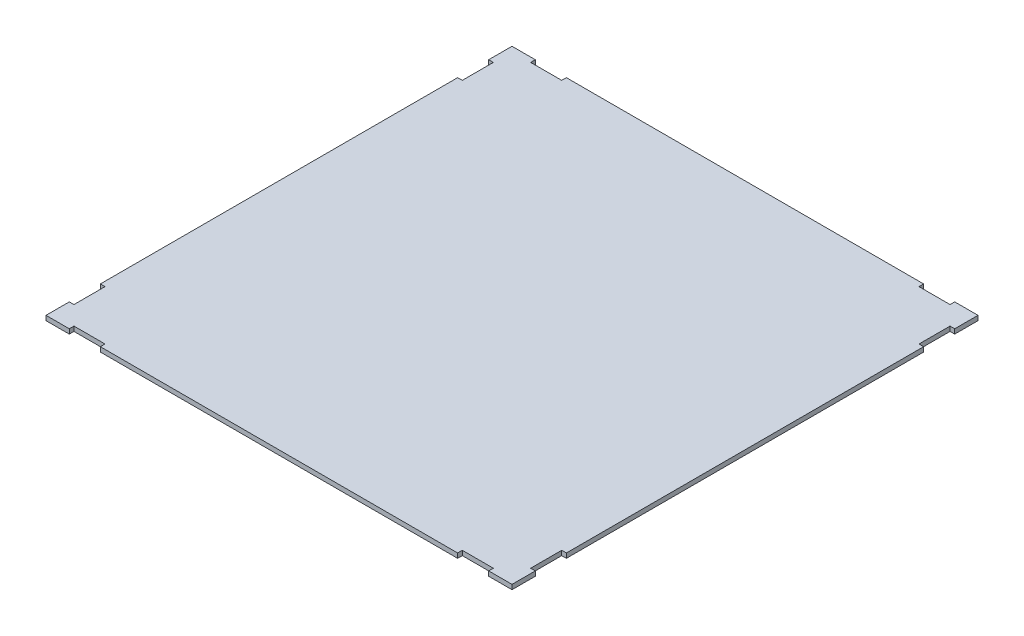
ISO-10303-21;
HEADER;
FILE_DESCRIPTION(('STEP AP214'),'2;1');
FILE_NAME('part.step','',(''),(''),'','','');
FILE_SCHEMA(('AUTOMOTIVE_DESIGN { 1 0 10303 214 1 1 1 1 }'));
ENDSEC;
DATA;
#1=APPLICATION_CONTEXT('core data for automotive mechanical design processes');
#2=APPLICATION_PROTOCOL_DEFINITION('international standard','automotive_design',2000,#1);
#3=PRODUCT_CONTEXT('',#1,'mechanical');
#4=PRODUCT('Part','Part','',(#3));
#5=PRODUCT_RELATED_PRODUCT_CATEGORY('part','',(#4));
#6=PRODUCT_DEFINITION_FORMATION('','',#4);
#7=PRODUCT_DEFINITION_CONTEXT('part definition',#1,'design');
#8=PRODUCT_DEFINITION('design','',#6,#7);
#9=PRODUCT_DEFINITION_SHAPE('','',#8);
#10=(LENGTH_UNIT() NAMED_UNIT(*) SI_UNIT(.MILLI.,.METRE.));
#11=(NAMED_UNIT(*) PLANE_ANGLE_UNIT() SI_UNIT($,.RADIAN.));
#12=(NAMED_UNIT(*) SI_UNIT($,.STERADIAN.) SOLID_ANGLE_UNIT());
#13=UNCERTAINTY_MEASURE_WITH_UNIT(LENGTH_MEASURE(1.E-05),#10,'distance_accuracy_value','');
#14=(GEOMETRIC_REPRESENTATION_CONTEXT(3) GLOBAL_UNCERTAINTY_ASSIGNED_CONTEXT((#13)) GLOBAL_UNIT_ASSIGNED_CONTEXT((#10,
#11,#12)) REPRESENTATION_CONTEXT('',''));
#15=CARTESIAN_POINT('',(0.,0.,0.));
#16=DIRECTION('',(0.,0.,1.));
#17=DIRECTION('',(1.,0.,0.));
#18=AXIS2_PLACEMENT_3D('',#15,#16,#17);
#19=CARTESIAN_POINT('',(0.,3.,0.));
#20=DIRECTION('',(1.,0.,0.));
#21=DIRECTION('',(0.,0.,-1.));
#22=AXIS2_PLACEMENT_3D('',#19,#20,#21);
#23=PLANE('',#22);
#24=DIRECTION('',(0.,0.,1.));
#25=VECTOR('',#24,1.);
#26=CARTESIAN_POINT('',(0.,0.,0.));
#27=LINE('',#26,#25);
#28=CARTESIAN_POINT('',(0.,0.,-15.));
#29=VERTEX_POINT('',#28);
#30=CARTESIAN_POINT('',(0.,0.,0.));
#31=VERTEX_POINT('',#30);
#32=EDGE_CURVE('E297',#29,#31,#27,.T.);
#33=ORIENTED_EDGE('',*,*,#32,.T.);
#34=DIRECTION('',(0.,-1.,0.));
#35=VECTOR('',#34,1.);
#36=CARTESIAN_POINT('',(0.,3.,0.));
#37=LINE('',#36,#35);
#38=CARTESIAN_POINT('',(0.,3.,0.));
#39=VERTEX_POINT('',#38);
#40=EDGE_CURVE('E11',#39,#31,#37,.T.);
#41=ORIENTED_EDGE('',*,*,#40,.F.);
#42=DIRECTION('',(0.,0.,1.));
#43=VECTOR('',#42,1.);
#44=CARTESIAN_POINT('',(0.,3.,0.));
#45=LINE('',#44,#43);
#46=CARTESIAN_POINT('',(0.,3.,-15.));
#47=VERTEX_POINT('',#46);
#48=EDGE_CURVE('E367',#47,#39,#45,.T.);
#49=ORIENTED_EDGE('',*,*,#48,.F.);
#50=DIRECTION('',(0.,-1.,0.));
#51=VECTOR('',#50,1.);
#52=CARTESIAN_POINT('',(0.,3.,-15.));
#53=LINE('',#52,#51);
#54=EDGE_CURVE('E293',#47,#29,#53,.T.);
#55=ORIENTED_EDGE('',*,*,#54,.T.);
#56=EDGE_LOOP('',(#33,#41,#49,#55));
#57=FACE_BOUND('',#56,.T.);
#58=ADVANCED_FACE('F33',(#57),#23,.F.);
#59=CARTESIAN_POINT('',(0.,3.,0.));
#60=DIRECTION('',(0.,0.,-1.));
#61=DIRECTION('',(-1.,0.,0.));
#62=AXIS2_PLACEMENT_3D('',#59,#60,#61);
#63=PLANE('',#62);
#64=DIRECTION('',(1.,0.,0.));
#65=VECTOR('',#64,1.);
#66=CARTESIAN_POINT('',(0.,0.,0.));
#67=LINE('',#66,#65);
#68=CARTESIAN_POINT('',(15.,0.,0.));
#69=VERTEX_POINT('',#68);
#70=EDGE_CURVE('E300',#31,#69,#67,.T.);
#71=ORIENTED_EDGE('',*,*,#70,.T.);
#72=DIRECTION('',(0.,-1.,0.));
#73=VECTOR('',#72,1.);
#74=CARTESIAN_POINT('',(15.,3.,0.));
#75=LINE('',#74,#73);
#76=CARTESIAN_POINT('',(15.,3.,0.));
#77=VERTEX_POINT('',#76);
#78=EDGE_CURVE('E41',#77,#69,#75,.T.);
#79=ORIENTED_EDGE('',*,*,#78,.F.);
#80=DIRECTION('',(1.,0.,0.));
#81=VECTOR('',#80,1.);
#82=CARTESIAN_POINT('',(0.,3.,0.));
#83=LINE('',#82,#81);
#84=EDGE_CURVE('E176',#39,#77,#83,.T.);
#85=ORIENTED_EDGE('',*,*,#84,.F.);
#86=ORIENTED_EDGE('',*,*,#40,.T.);
#87=EDGE_LOOP('',(#71,#79,#85,#86));
#88=FACE_BOUND('',#87,.T.);
#89=ADVANCED_FACE('F565',(#88),#63,.F.);
#90=CARTESIAN_POINT('',(15.,3.,0.));
#91=DIRECTION('',(-1.,0.,0.));
#92=DIRECTION('',(0.,0.,1.));
#93=AXIS2_PLACEMENT_3D('',#90,#91,#92);
#94=PLANE('',#93);
#95=DIRECTION('',(0.,0.,-1.));
#96=VECTOR('',#95,1.);
#97=CARTESIAN_POINT('',(15.,0.,0.));
#98=LINE('',#97,#96);
#99=CARTESIAN_POINT('',(15.,0.,-3.));
#100=VERTEX_POINT('',#99);
#101=EDGE_CURVE('E302',#69,#100,#98,.T.);
#102=ORIENTED_EDGE('',*,*,#101,.T.);
#103=DIRECTION('',(0.,-1.,0.));
#104=VECTOR('',#103,1.);
#105=CARTESIAN_POINT('',(15.,3.,-3.));
#106=LINE('',#105,#104);
#107=CARTESIAN_POINT('',(15.,3.,-3.));
#108=VERTEX_POINT('',#107);
#109=EDGE_CURVE('E458',#108,#100,#106,.T.);
#110=ORIENTED_EDGE('',*,*,#109,.F.);
#111=DIRECTION('',(0.,0.,-1.));
#112=VECTOR('',#111,1.);
#113=CARTESIAN_POINT('',(15.,3.,0.));
#114=LINE('',#113,#112);
#115=EDGE_CURVE('E466',#77,#108,#114,.T.);
#116=ORIENTED_EDGE('',*,*,#115,.F.);
#117=ORIENTED_EDGE('',*,*,#78,.T.);
#118=EDGE_LOOP('',(#102,#110,#116,#117));
#119=FACE_BOUND('',#118,.T.);
#120=ADVANCED_FACE('F464',(#119),#94,.F.);
#121=CARTESIAN_POINT('',(15.,3.,-3.));
#122=DIRECTION('',(0.,0.,-1.));
#123=DIRECTION('',(-1.,0.,0.));
#124=AXIS2_PLACEMENT_3D('',#121,#122,#123);
#125=PLANE('',#124);
#126=DIRECTION('',(1.,0.,0.));
#127=VECTOR('',#126,1.);
#128=CARTESIAN_POINT('',(15.,0.,-3.));
#129=LINE('',#128,#127);
#130=CARTESIAN_POINT('',(35.,0.,-3.));
#131=VERTEX_POINT('',#130);
#132=EDGE_CURVE('E304',#100,#131,#129,.T.);
#133=ORIENTED_EDGE('',*,*,#132,.T.);
#134=DIRECTION('',(0.,-1.,0.));
#135=VECTOR('',#134,1.);
#136=CARTESIAN_POINT('',(35.,3.,-3.));
#137=LINE('',#136,#135);
#138=CARTESIAN_POINT('',(35.,3.,-3.));
#139=VERTEX_POINT('',#138);
#140=EDGE_CURVE('E455',#139,#131,#137,.T.);
#141=ORIENTED_EDGE('',*,*,#140,.F.);
#142=DIRECTION('',(1.,0.,0.));
#143=VECTOR('',#142,1.);
#144=CARTESIAN_POINT('',(15.,3.,-3.));
#145=LINE('',#144,#143);
#146=EDGE_CURVE('E484',#108,#139,#145,.T.);
#147=ORIENTED_EDGE('',*,*,#146,.F.);
#148=ORIENTED_EDGE('',*,*,#109,.T.);
#149=EDGE_LOOP('',(#133,#141,#147,#148));
#150=FACE_BOUND('',#149,.T.);
#151=ADVANCED_FACE('F475',(#150),#125,.F.);
#152=CARTESIAN_POINT('',(35.,3.,-3.));
#153=DIRECTION('',(1.,0.,0.));
#154=DIRECTION('',(0.,0.,-1.));
#155=AXIS2_PLACEMENT_3D('',#152,#153,#154);
#156=PLANE('',#155);
#157=DIRECTION('',(0.,0.,1.));
#158=VECTOR('',#157,1.);
#159=CARTESIAN_POINT('',(35.,0.,-3.));
#160=LINE('',#159,#158);
#161=CARTESIAN_POINT('',(35.,0.,0.));
#162=VERTEX_POINT('',#161);
#163=EDGE_CURVE('E306',#131,#162,#160,.T.);
#164=ORIENTED_EDGE('',*,*,#163,.T.);
#165=DIRECTION('',(0.,-1.,0.));
#166=VECTOR('',#165,1.);
#167=CARTESIAN_POINT('',(35.,3.,0.));
#168=LINE('',#167,#166);
#169=CARTESIAN_POINT('',(35.,3.,0.));
#170=VERTEX_POINT('',#169);
#171=EDGE_CURVE('E452',#170,#162,#168,.T.);
#172=ORIENTED_EDGE('',*,*,#171,.F.);
#173=DIRECTION('',(0.,0.,1.));
#174=VECTOR('',#173,1.);
#175=CARTESIAN_POINT('',(35.,3.,-3.));
#176=LINE('',#175,#174);
#177=EDGE_CURVE('E481',#139,#170,#176,.T.);
#178=ORIENTED_EDGE('',*,*,#177,.F.);
#179=ORIENTED_EDGE('',*,*,#140,.T.);
#180=EDGE_LOOP('',(#164,#172,#178,#179));
#181=FACE_BOUND('',#180,.T.);
#182=ADVANCED_FACE('F479',(#181),#156,.F.);
#183=CARTESIAN_POINT('',(35.,3.,0.));
#184=DIRECTION('',(0.,0.,-1.));
#185=DIRECTION('',(-1.,0.,0.));
#186=AXIS2_PLACEMENT_3D('',#183,#184,#185);
#187=PLANE('',#186);
#188=DIRECTION('',(1.,0.,0.));
#189=VECTOR('',#188,1.);
#190=CARTESIAN_POINT('',(35.,0.,0.));
#191=LINE('',#190,#189);
#192=CARTESIAN_POINT('',(265.,0.,0.));
#193=VERTEX_POINT('',#192);
#194=EDGE_CURVE('E308',#162,#193,#191,.T.);
#195=ORIENTED_EDGE('',*,*,#194,.T.);
#196=DIRECTION('',(0.,-1.,0.));
#197=VECTOR('',#196,1.);
#198=CARTESIAN_POINT('',(265.,3.,0.));
#199=LINE('',#198,#197);
#200=CARTESIAN_POINT('',(265.,3.,0.));
#201=VERTEX_POINT('',#200);
#202=EDGE_CURVE('E449',#201,#193,#199,.T.);
#203=ORIENTED_EDGE('',*,*,#202,.F.);
#204=DIRECTION('',(1.,0.,0.));
#205=VECTOR('',#204,1.);
#206=CARTESIAN_POINT('',(35.,3.,0.));
#207=LINE('',#206,#205);
#208=EDGE_CURVE('E483',#170,#201,#207,.T.);
#209=ORIENTED_EDGE('',*,*,#208,.F.);
#210=ORIENTED_EDGE('',*,*,#171,.T.);
#211=EDGE_LOOP('',(#195,#203,#209,#210));
#212=FACE_BOUND('',#211,.T.);
#213=ADVANCED_FACE('F578',(#212),#187,.F.);
#214=CARTESIAN_POINT('',(265.,3.,-3.));
#215=DIRECTION('',(-1.,0.,0.));
#216=DIRECTION('',(0.,0.,1.));
#217=AXIS2_PLACEMENT_3D('',#214,#215,#216);
#218=PLANE('',#217);
#219=DIRECTION('',(0.,0.,-1.));
#220=VECTOR('',#219,1.);
#221=CARTESIAN_POINT('',(265.,0.,-3.));
#222=LINE('',#221,#220);
#223=CARTESIAN_POINT('',(265.,0.,-3.));
#224=VERTEX_POINT('',#223);
#225=EDGE_CURVE('E310',#193,#224,#222,.T.);
#226=ORIENTED_EDGE('',*,*,#225,.T.);
#227=DIRECTION('',(0.,-1.,0.));
#228=VECTOR('',#227,1.);
#229=CARTESIAN_POINT('',(265.,3.,-3.));
#230=LINE('',#229,#228);
#231=CARTESIAN_POINT('',(265.,3.,-3.));
#232=VERTEX_POINT('',#231);
#233=EDGE_CURVE('E446',#232,#224,#230,.T.);
#234=ORIENTED_EDGE('',*,*,#233,.F.);
#235=DIRECTION('',(0.,0.,-1.));
#236=VECTOR('',#235,1.);
#237=CARTESIAN_POINT('',(265.,3.,-3.));
#238=LINE('',#237,#236);
#239=EDGE_CURVE('E486',#201,#232,#238,.T.);
#240=ORIENTED_EDGE('',*,*,#239,.F.);
#241=ORIENTED_EDGE('',*,*,#202,.T.);
#242=EDGE_LOOP('',(#226,#234,#240,#241));
#243=FACE_BOUND('',#242,.T.);
#244=ADVANCED_FACE('F581',(#243),#218,.F.);
#245=CARTESIAN_POINT('',(285.,3.,-3.));
#246=DIRECTION('',(0.,0.,-1.));
#247=DIRECTION('',(-1.,0.,0.));
#248=AXIS2_PLACEMENT_3D('',#245,#246,#247);
#249=PLANE('',#248);
#250=DIRECTION('',(1.,0.,0.));
#251=VECTOR('',#250,1.);
#252=CARTESIAN_POINT('',(285.,0.,-3.));
#253=LINE('',#252,#251);
#254=CARTESIAN_POINT('',(285.,0.,-3.));
#255=VERTEX_POINT('',#254);
#256=EDGE_CURVE('E312',#224,#255,#253,.T.);
#257=ORIENTED_EDGE('',*,*,#256,.T.);
#258=DIRECTION('',(0.,-1.,0.));
#259=VECTOR('',#258,1.);
#260=CARTESIAN_POINT('',(285.,3.,-3.));
#261=LINE('',#260,#259);
#262=CARTESIAN_POINT('',(285.,3.,-3.));
#263=VERTEX_POINT('',#262);
#264=EDGE_CURVE('E443',#263,#255,#261,.T.);
#265=ORIENTED_EDGE('',*,*,#264,.F.);
#266=DIRECTION('',(1.,0.,0.));
#267=VECTOR('',#266,1.);
#268=CARTESIAN_POINT('',(285.,3.,-3.));
#269=LINE('',#268,#267);
#270=EDGE_CURVE('E492',#232,#263,#269,.T.);
#271=ORIENTED_EDGE('',*,*,#270,.F.);
#272=ORIENTED_EDGE('',*,*,#233,.T.);
#273=EDGE_LOOP('',(#257,#265,#271,#272));
#274=FACE_BOUND('',#273,.T.);
#275=ADVANCED_FACE('F585',(#274),#249,.F.);
#276=CARTESIAN_POINT('',(285.,3.,0.));
#277=DIRECTION('',(1.,0.,0.));
#278=DIRECTION('',(0.,0.,-1.));
#279=AXIS2_PLACEMENT_3D('',#276,#277,#278);
#280=PLANE('',#279);
#281=DIRECTION('',(0.,0.,1.));
#282=VECTOR('',#281,1.);
#283=CARTESIAN_POINT('',(285.,0.,0.));
#284=LINE('',#283,#282);
#285=CARTESIAN_POINT('',(285.,0.,0.));
#286=VERTEX_POINT('',#285);
#287=EDGE_CURVE('E314',#255,#286,#284,.T.);
#288=ORIENTED_EDGE('',*,*,#287,.T.);
#289=DIRECTION('',(0.,-1.,0.));
#290=VECTOR('',#289,1.);
#291=CARTESIAN_POINT('',(285.,3.,0.));
#292=LINE('',#291,#290);
#293=CARTESIAN_POINT('',(285.,3.,0.));
#294=VERTEX_POINT('',#293);
#295=EDGE_CURVE('E440',#294,#286,#292,.T.);
#296=ORIENTED_EDGE('',*,*,#295,.F.);
#297=DIRECTION('',(0.,0.,1.));
#298=VECTOR('',#297,1.);
#299=CARTESIAN_POINT('',(285.,3.,0.));
#300=LINE('',#299,#298);
#301=EDGE_CURVE('E494',#263,#294,#300,.T.);
#302=ORIENTED_EDGE('',*,*,#301,.F.);
#303=ORIENTED_EDGE('',*,*,#264,.T.);
#304=EDGE_LOOP('',(#288,#296,#302,#303));
#305=FACE_BOUND('',#304,.T.);
#306=ADVANCED_FACE('F589',(#305),#280,.F.);
#307=CARTESIAN_POINT('',(300.,3.,0.));
#308=DIRECTION('',(0.,0.,-1.));
#309=DIRECTION('',(-1.,0.,0.));
#310=AXIS2_PLACEMENT_3D('',#307,#308,#309);
#311=PLANE('',#310);
#312=DIRECTION('',(1.,0.,0.));
#313=VECTOR('',#312,1.);
#314=CARTESIAN_POINT('',(300.,0.,0.));
#315=LINE('',#314,#313);
#316=CARTESIAN_POINT('',(300.,0.,0.));
#317=VERTEX_POINT('',#316);
#318=EDGE_CURVE('E316',#286,#317,#315,.T.);
#319=ORIENTED_EDGE('',*,*,#318,.T.);
#320=DIRECTION('',(0.,-1.,0.));
#321=VECTOR('',#320,1.);
#322=CARTESIAN_POINT('',(300.,3.,0.));
#323=LINE('',#322,#321);
#324=CARTESIAN_POINT('',(300.,3.,0.));
#325=VERTEX_POINT('',#324);
#326=EDGE_CURVE('E437',#325,#317,#323,.T.);
#327=ORIENTED_EDGE('',*,*,#326,.F.);
#328=DIRECTION('',(1.,0.,0.));
#329=VECTOR('',#328,1.);
#330=CARTESIAN_POINT('',(300.,3.,0.));
#331=LINE('',#330,#329);
#332=EDGE_CURVE('E496',#294,#325,#331,.T.);
#333=ORIENTED_EDGE('',*,*,#332,.F.);
#334=ORIENTED_EDGE('',*,*,#295,.T.);
#335=EDGE_LOOP('',(#319,#327,#333,#334));
#336=FACE_BOUND('',#335,.T.);
#337=ADVANCED_FACE('F593',(#336),#311,.F.);
#338=CARTESIAN_POINT('',(300.,3.,0.));
#339=DIRECTION('',(-1.,0.,0.));
#340=DIRECTION('',(0.,0.,1.));
#341=AXIS2_PLACEMENT_3D('',#338,#339,#340);
#342=PLANE('',#341);
#343=DIRECTION('',(0.,0.,-1.));
#344=VECTOR('',#343,1.);
#345=CARTESIAN_POINT('',(300.,0.,0.));
#346=LINE('',#345,#344);
#347=CARTESIAN_POINT('',(300.,0.,-15.));
#348=VERTEX_POINT('',#347);
#349=EDGE_CURVE('E318',#317,#348,#346,.T.);
#350=ORIENTED_EDGE('',*,*,#349,.T.);
#351=DIRECTION('',(0.,-1.,0.));
#352=VECTOR('',#351,1.);
#353=CARTESIAN_POINT('',(300.,3.,-15.));
#354=LINE('',#353,#352);
#355=CARTESIAN_POINT('',(300.,3.,-15.));
#356=VERTEX_POINT('',#355);
#357=EDGE_CURVE('E434',#356,#348,#354,.T.);
#358=ORIENTED_EDGE('',*,*,#357,.F.);
#359=DIRECTION('',(0.,0.,-1.));
#360=VECTOR('',#359,1.);
#361=CARTESIAN_POINT('',(300.,3.,0.));
#362=LINE('',#361,#360);
#363=EDGE_CURVE('E498',#325,#356,#362,.T.);
#364=ORIENTED_EDGE('',*,*,#363,.F.);
#365=ORIENTED_EDGE('',*,*,#326,.T.);
#366=EDGE_LOOP('',(#350,#358,#364,#365));
#367=FACE_BOUND('',#366,.T.);
#368=ADVANCED_FACE('F597',(#367),#342,.F.);
#369=CARTESIAN_POINT('',(300.,3.,-15.));
#370=DIRECTION('',(0.,0.,1.));
#371=DIRECTION('',(1.,0.,0.));
#372=AXIS2_PLACEMENT_3D('',#369,#370,#371);
#373=PLANE('',#372);
#374=DIRECTION('',(-1.,0.,0.));
#375=VECTOR('',#374,1.);
#376=CARTESIAN_POINT('',(300.,0.,-15.));
#377=LINE('',#376,#375);
#378=CARTESIAN_POINT('',(297.,0.,-15.));
#379=VERTEX_POINT('',#378);
#380=EDGE_CURVE('E320',#348,#379,#377,.T.);
#381=ORIENTED_EDGE('',*,*,#380,.T.);
#382=DIRECTION('',(0.,-1.,0.));
#383=VECTOR('',#382,1.);
#384=CARTESIAN_POINT('',(297.,3.,-15.));
#385=LINE('',#384,#383);
#386=CARTESIAN_POINT('',(297.,3.,-15.));
#387=VERTEX_POINT('',#386);
#388=EDGE_CURVE('E431',#387,#379,#385,.T.);
#389=ORIENTED_EDGE('',*,*,#388,.F.);
#390=DIRECTION('',(-1.,0.,0.));
#391=VECTOR('',#390,1.);
#392=CARTESIAN_POINT('',(300.,3.,-15.));
#393=LINE('',#392,#391);
#394=EDGE_CURVE('E500',#356,#387,#393,.T.);
#395=ORIENTED_EDGE('',*,*,#394,.F.);
#396=ORIENTED_EDGE('',*,*,#357,.T.);
#397=EDGE_LOOP('',(#381,#389,#395,#396));
#398=FACE_BOUND('',#397,.T.);
#399=ADVANCED_FACE('F601',(#398),#373,.F.);
#400=CARTESIAN_POINT('',(297.,3.,-15.));
#401=DIRECTION('',(-1.,0.,0.));
#402=DIRECTION('',(0.,0.,1.));
#403=AXIS2_PLACEMENT_3D('',#400,#401,#402);
#404=PLANE('',#403);
#405=DIRECTION('',(0.,0.,-1.));
#406=VECTOR('',#405,1.);
#407=CARTESIAN_POINT('',(297.,0.,-15.));
#408=LINE('',#407,#406);
#409=CARTESIAN_POINT('',(297.,0.,-35.));
#410=VERTEX_POINT('',#409);
#411=EDGE_CURVE('E322',#379,#410,#408,.T.);
#412=ORIENTED_EDGE('',*,*,#411,.T.);
#413=DIRECTION('',(0.,-1.,0.));
#414=VECTOR('',#413,1.);
#415=CARTESIAN_POINT('',(297.,3.,-35.));
#416=LINE('',#415,#414);
#417=CARTESIAN_POINT('',(297.,3.,-35.));
#418=VERTEX_POINT('',#417);
#419=EDGE_CURVE('E428',#418,#410,#416,.T.);
#420=ORIENTED_EDGE('',*,*,#419,.F.);
#421=DIRECTION('',(0.,0.,-1.));
#422=VECTOR('',#421,1.);
#423=CARTESIAN_POINT('',(297.,3.,-15.));
#424=LINE('',#423,#422);
#425=EDGE_CURVE('E502',#387,#418,#424,.T.);
#426=ORIENTED_EDGE('',*,*,#425,.F.);
#427=ORIENTED_EDGE('',*,*,#388,.T.);
#428=EDGE_LOOP('',(#412,#420,#426,#427));
#429=FACE_BOUND('',#428,.T.);
#430=ADVANCED_FACE('F605',(#429),#404,.F.);
#431=CARTESIAN_POINT('',(297.,3.,-35.));
#432=DIRECTION('',(0.,0.,-1.));
#433=DIRECTION('',(-1.,0.,0.));
#434=AXIS2_PLACEMENT_3D('',#431,#432,#433);
#435=PLANE('',#434);
#436=DIRECTION('',(1.,0.,0.));
#437=VECTOR('',#436,1.);
#438=CARTESIAN_POINT('',(297.,0.,-35.));
#439=LINE('',#438,#437);
#440=CARTESIAN_POINT('',(300.,0.,-35.));
#441=VERTEX_POINT('',#440);
#442=EDGE_CURVE('E324',#410,#441,#439,.T.);
#443=ORIENTED_EDGE('',*,*,#442,.T.);
#444=DIRECTION('',(0.,-1.,0.));
#445=VECTOR('',#444,1.);
#446=CARTESIAN_POINT('',(300.,3.,-35.));
#447=LINE('',#446,#445);
#448=CARTESIAN_POINT('',(300.,3.,-35.));
#449=VERTEX_POINT('',#448);
#450=EDGE_CURVE('E425',#449,#441,#447,.T.);
#451=ORIENTED_EDGE('',*,*,#450,.F.);
#452=DIRECTION('',(1.,0.,0.));
#453=VECTOR('',#452,1.);
#454=CARTESIAN_POINT('',(297.,3.,-35.));
#455=LINE('',#454,#453);
#456=EDGE_CURVE('E504',#418,#449,#455,.T.);
#457=ORIENTED_EDGE('',*,*,#456,.F.);
#458=ORIENTED_EDGE('',*,*,#419,.T.);
#459=EDGE_LOOP('',(#443,#451,#457,#458));
#460=FACE_BOUND('',#459,.T.);
#461=ADVANCED_FACE('F609',(#460),#435,.F.);
#462=CARTESIAN_POINT('',(300.,3.,-35.));
#463=DIRECTION('',(-1.,0.,0.));
#464=DIRECTION('',(0.,0.,1.));
#465=AXIS2_PLACEMENT_3D('',#462,#463,#464);
#466=PLANE('',#465);
#467=DIRECTION('',(0.,0.,-1.));
#468=VECTOR('',#467,1.);
#469=CARTESIAN_POINT('',(300.,0.,-35.));
#470=LINE('',#469,#468);
#471=CARTESIAN_POINT('',(300.,0.,-265.));
#472=VERTEX_POINT('',#471);
#473=EDGE_CURVE('E326',#441,#472,#470,.T.);
#474=ORIENTED_EDGE('',*,*,#473,.T.);
#475=DIRECTION('',(0.,-1.,0.));
#476=VECTOR('',#475,1.);
#477=CARTESIAN_POINT('',(300.,3.,-265.));
#478=LINE('',#477,#476);
#479=CARTESIAN_POINT('',(300.,3.,-265.));
#480=VERTEX_POINT('',#479);
#481=EDGE_CURVE('E422',#480,#472,#478,.T.);
#482=ORIENTED_EDGE('',*,*,#481,.F.);
#483=DIRECTION('',(0.,0.,-1.));
#484=VECTOR('',#483,1.);
#485=CARTESIAN_POINT('',(300.,3.,-35.));
#486=LINE('',#485,#484);
#487=EDGE_CURVE('E506',#449,#480,#486,.T.);
#488=ORIENTED_EDGE('',*,*,#487,.F.);
#489=ORIENTED_EDGE('',*,*,#450,.T.);
#490=EDGE_LOOP('',(#474,#482,#488,#489));
#491=FACE_BOUND('',#490,.T.);
#492=ADVANCED_FACE('F613',(#491),#466,.F.);
#493=CARTESIAN_POINT('',(297.,3.,-265.));
#494=DIRECTION('',(0.,0.,1.));
#495=DIRECTION('',(1.,0.,0.));
#496=AXIS2_PLACEMENT_3D('',#493,#494,#495);
#497=PLANE('',#496);
#498=DIRECTION('',(-1.,0.,0.));
#499=VECTOR('',#498,1.);
#500=CARTESIAN_POINT('',(297.,0.,-265.));
#501=LINE('',#500,#499);
#502=CARTESIAN_POINT('',(297.,0.,-265.));
#503=VERTEX_POINT('',#502);
#504=EDGE_CURVE('E328',#472,#503,#501,.T.);
#505=ORIENTED_EDGE('',*,*,#504,.T.);
#506=DIRECTION('',(0.,-1.,0.));
#507=VECTOR('',#506,1.);
#508=CARTESIAN_POINT('',(297.,3.,-265.));
#509=LINE('',#508,#507);
#510=CARTESIAN_POINT('',(297.,3.,-265.));
#511=VERTEX_POINT('',#510);
#512=EDGE_CURVE('E419',#511,#503,#509,.T.);
#513=ORIENTED_EDGE('',*,*,#512,.F.);
#514=DIRECTION('',(-1.,0.,0.));
#515=VECTOR('',#514,1.);
#516=CARTESIAN_POINT('',(297.,3.,-265.));
#517=LINE('',#516,#515);
#518=EDGE_CURVE('E508',#480,#511,#517,.T.);
#519=ORIENTED_EDGE('',*,*,#518,.F.);
#520=ORIENTED_EDGE('',*,*,#481,.T.);
#521=EDGE_LOOP('',(#505,#513,#519,#520));
#522=FACE_BOUND('',#521,.T.);
#523=ADVANCED_FACE('F617',(#522),#497,.F.);
#524=CARTESIAN_POINT('',(297.,3.,-285.));
#525=DIRECTION('',(-1.,0.,0.));
#526=DIRECTION('',(0.,0.,1.));
#527=AXIS2_PLACEMENT_3D('',#524,#525,#526);
#528=PLANE('',#527);
#529=DIRECTION('',(0.,0.,-1.));
#530=VECTOR('',#529,1.);
#531=CARTESIAN_POINT('',(297.,0.,-285.));
#532=LINE('',#531,#530);
#533=CARTESIAN_POINT('',(297.,0.,-285.));
#534=VERTEX_POINT('',#533);
#535=EDGE_CURVE('E330',#503,#534,#532,.T.);
#536=ORIENTED_EDGE('',*,*,#535,.T.);
#537=DIRECTION('',(0.,-1.,0.));
#538=VECTOR('',#537,1.);
#539=CARTESIAN_POINT('',(297.,3.,-285.));
#540=LINE('',#539,#538);
#541=CARTESIAN_POINT('',(297.,3.,-285.));
#542=VERTEX_POINT('',#541);
#543=EDGE_CURVE('E416',#542,#534,#540,.T.);
#544=ORIENTED_EDGE('',*,*,#543,.F.);
#545=DIRECTION('',(0.,0.,-1.));
#546=VECTOR('',#545,1.);
#547=CARTESIAN_POINT('',(297.,3.,-285.));
#548=LINE('',#547,#546);
#549=EDGE_CURVE('E510',#511,#542,#548,.T.);
#550=ORIENTED_EDGE('',*,*,#549,.F.);
#551=ORIENTED_EDGE('',*,*,#512,.T.);
#552=EDGE_LOOP('',(#536,#544,#550,#551));
#553=FACE_BOUND('',#552,.T.);
#554=ADVANCED_FACE('F621',(#553),#528,.F.);
#555=CARTESIAN_POINT('',(300.,3.,-285.));
#556=DIRECTION('',(0.,0.,-1.));
#557=DIRECTION('',(-1.,0.,0.));
#558=AXIS2_PLACEMENT_3D('',#555,#556,#557);
#559=PLANE('',#558);
#560=DIRECTION('',(1.,0.,0.));
#561=VECTOR('',#560,1.);
#562=CARTESIAN_POINT('',(300.,0.,-285.));
#563=LINE('',#562,#561);
#564=CARTESIAN_POINT('',(300.,0.,-285.));
#565=VERTEX_POINT('',#564);
#566=EDGE_CURVE('E332',#534,#565,#563,.T.);
#567=ORIENTED_EDGE('',*,*,#566,.T.);
#568=DIRECTION('',(0.,-1.,0.));
#569=VECTOR('',#568,1.);
#570=CARTESIAN_POINT('',(300.,3.,-285.));
#571=LINE('',#570,#569);
#572=CARTESIAN_POINT('',(300.,3.,-285.));
#573=VERTEX_POINT('',#572);
#574=EDGE_CURVE('E413',#573,#565,#571,.T.);
#575=ORIENTED_EDGE('',*,*,#574,.F.);
#576=DIRECTION('',(1.,0.,0.));
#577=VECTOR('',#576,1.);
#578=CARTESIAN_POINT('',(300.,3.,-285.));
#579=LINE('',#578,#577);
#580=EDGE_CURVE('E512',#542,#573,#579,.T.);
#581=ORIENTED_EDGE('',*,*,#580,.F.);
#582=ORIENTED_EDGE('',*,*,#543,.T.);
#583=EDGE_LOOP('',(#567,#575,#581,#582));
#584=FACE_BOUND('',#583,.T.);
#585=ADVANCED_FACE('F625',(#584),#559,.F.);
#586=CARTESIAN_POINT('',(300.,3.,-300.));
#587=DIRECTION('',(-1.,0.,0.));
#588=DIRECTION('',(0.,0.,1.));
#589=AXIS2_PLACEMENT_3D('',#586,#587,#588);
#590=PLANE('',#589);
#591=DIRECTION('',(0.,0.,-1.));
#592=VECTOR('',#591,1.);
#593=CARTESIAN_POINT('',(300.,0.,-300.));
#594=LINE('',#593,#592);
#595=CARTESIAN_POINT('',(300.,0.,-300.));
#596=VERTEX_POINT('',#595);
#597=EDGE_CURVE('E334',#565,#596,#594,.T.);
#598=ORIENTED_EDGE('',*,*,#597,.T.);
#599=DIRECTION('',(0.,-1.,0.));
#600=VECTOR('',#599,1.);
#601=CARTESIAN_POINT('',(300.,3.,-300.));
#602=LINE('',#601,#600);
#603=CARTESIAN_POINT('',(300.,3.,-300.));
#604=VERTEX_POINT('',#603);
#605=EDGE_CURVE('E410',#604,#596,#602,.T.);
#606=ORIENTED_EDGE('',*,*,#605,.F.);
#607=DIRECTION('',(0.,0.,-1.));
#608=VECTOR('',#607,1.);
#609=CARTESIAN_POINT('',(300.,3.,-300.));
#610=LINE('',#609,#608);
#611=EDGE_CURVE('E514',#573,#604,#610,.T.);
#612=ORIENTED_EDGE('',*,*,#611,.F.);
#613=ORIENTED_EDGE('',*,*,#574,.T.);
#614=EDGE_LOOP('',(#598,#606,#612,#613));
#615=FACE_BOUND('',#614,.T.);
#616=ADVANCED_FACE('F629',(#615),#590,.F.);
#617=CARTESIAN_POINT('',(300.,3.,-300.));
#618=DIRECTION('',(0.,0.,1.));
#619=DIRECTION('',(1.,0.,0.));
#620=AXIS2_PLACEMENT_3D('',#617,#618,#619);
#621=PLANE('',#620);
#622=DIRECTION('',(-1.,0.,0.));
#623=VECTOR('',#622,1.);
#624=CARTESIAN_POINT('',(300.,0.,-300.));
#625=LINE('',#624,#623);
#626=CARTESIAN_POINT('',(285.,0.,-300.));
#627=VERTEX_POINT('',#626);
#628=EDGE_CURVE('E336',#596,#627,#625,.T.);
#629=ORIENTED_EDGE('',*,*,#628,.T.);
#630=DIRECTION('',(0.,-1.,0.));
#631=VECTOR('',#630,1.);
#632=CARTESIAN_POINT('',(285.,3.,-300.));
#633=LINE('',#632,#631);
#634=CARTESIAN_POINT('',(285.,3.,-300.));
#635=VERTEX_POINT('',#634);
#636=EDGE_CURVE('E407',#635,#627,#633,.T.);
#637=ORIENTED_EDGE('',*,*,#636,.F.);
#638=DIRECTION('',(-1.,0.,0.));
#639=VECTOR('',#638,1.);
#640=CARTESIAN_POINT('',(300.,3.,-300.));
#641=LINE('',#640,#639);
#642=EDGE_CURVE('E516',#604,#635,#641,.T.);
#643=ORIENTED_EDGE('',*,*,#642,.F.);
#644=ORIENTED_EDGE('',*,*,#605,.T.);
#645=EDGE_LOOP('',(#629,#637,#643,#644));
#646=FACE_BOUND('',#645,.T.);
#647=ADVANCED_FACE('F633',(#646),#621,.F.);
#648=CARTESIAN_POINT('',(285.,3.,-300.));
#649=DIRECTION('',(1.,0.,0.));
#650=DIRECTION('',(0.,0.,-1.));
#651=AXIS2_PLACEMENT_3D('',#648,#649,#650);
#652=PLANE('',#651);
#653=DIRECTION('',(0.,0.,1.));
#654=VECTOR('',#653,1.);
#655=CARTESIAN_POINT('',(285.,0.,-300.));
#656=LINE('',#655,#654);
#657=CARTESIAN_POINT('',(285.,0.,-297.));
#658=VERTEX_POINT('',#657);
#659=EDGE_CURVE('E338',#627,#658,#656,.T.);
#660=ORIENTED_EDGE('',*,*,#659,.T.);
#661=DIRECTION('',(0.,-1.,0.));
#662=VECTOR('',#661,1.);
#663=CARTESIAN_POINT('',(285.,3.,-297.));
#664=LINE('',#663,#662);
#665=CARTESIAN_POINT('',(285.,3.,-297.));
#666=VERTEX_POINT('',#665);
#667=EDGE_CURVE('E404',#666,#658,#664,.T.);
#668=ORIENTED_EDGE('',*,*,#667,.F.);
#669=DIRECTION('',(0.,0.,1.));
#670=VECTOR('',#669,1.);
#671=CARTESIAN_POINT('',(285.,3.,-300.));
#672=LINE('',#671,#670);
#673=EDGE_CURVE('E518',#635,#666,#672,.T.);
#674=ORIENTED_EDGE('',*,*,#673,.F.);
#675=ORIENTED_EDGE('',*,*,#636,.T.);
#676=EDGE_LOOP('',(#660,#668,#674,#675));
#677=FACE_BOUND('',#676,.T.);
#678=ADVANCED_FACE('F637',(#677),#652,.F.);
#679=CARTESIAN_POINT('',(285.,3.,-297.));
#680=DIRECTION('',(0.,0.,1.));
#681=DIRECTION('',(1.,0.,0.));
#682=AXIS2_PLACEMENT_3D('',#679,#680,#681);
#683=PLANE('',#682);
#684=DIRECTION('',(-1.,0.,0.));
#685=VECTOR('',#684,1.);
#686=CARTESIAN_POINT('',(285.,0.,-297.));
#687=LINE('',#686,#685);
#688=CARTESIAN_POINT('',(265.,0.,-297.));
#689=VERTEX_POINT('',#688);
#690=EDGE_CURVE('E340',#658,#689,#687,.T.);
#691=ORIENTED_EDGE('',*,*,#690,.T.);
#692=DIRECTION('',(0.,-1.,0.));
#693=VECTOR('',#692,1.);
#694=CARTESIAN_POINT('',(265.,3.,-297.));
#695=LINE('',#694,#693);
#696=CARTESIAN_POINT('',(265.,3.,-297.));
#697=VERTEX_POINT('',#696);
#698=EDGE_CURVE('E401',#697,#689,#695,.T.);
#699=ORIENTED_EDGE('',*,*,#698,.F.);
#700=DIRECTION('',(-1.,0.,0.));
#701=VECTOR('',#700,1.);
#702=CARTESIAN_POINT('',(285.,3.,-297.));
#703=LINE('',#702,#701);
#704=EDGE_CURVE('E520',#666,#697,#703,.T.);
#705=ORIENTED_EDGE('',*,*,#704,.F.);
#706=ORIENTED_EDGE('',*,*,#667,.T.);
#707=EDGE_LOOP('',(#691,#699,#705,#706));
#708=FACE_BOUND('',#707,.T.);
#709=ADVANCED_FACE('F641',(#708),#683,.F.);
#710=CARTESIAN_POINT('',(265.,3.,-297.));
#711=DIRECTION('',(-1.,0.,0.));
#712=DIRECTION('',(0.,0.,1.));
#713=AXIS2_PLACEMENT_3D('',#710,#711,#712);
#714=PLANE('',#713);
#715=DIRECTION('',(0.,0.,-1.));
#716=VECTOR('',#715,1.);
#717=CARTESIAN_POINT('',(265.,0.,-297.));
#718=LINE('',#717,#716);
#719=CARTESIAN_POINT('',(265.,0.,-300.));
#720=VERTEX_POINT('',#719);
#721=EDGE_CURVE('E342',#689,#720,#718,.T.);
#722=ORIENTED_EDGE('',*,*,#721,.T.);
#723=DIRECTION('',(0.,-1.,0.));
#724=VECTOR('',#723,1.);
#725=CARTESIAN_POINT('',(265.,3.,-300.));
#726=LINE('',#725,#724);
#727=CARTESIAN_POINT('',(265.,3.,-300.));
#728=VERTEX_POINT('',#727);
#729=EDGE_CURVE('E398',#728,#720,#726,.T.);
#730=ORIENTED_EDGE('',*,*,#729,.F.);
#731=DIRECTION('',(0.,0.,-1.));
#732=VECTOR('',#731,1.);
#733=CARTESIAN_POINT('',(265.,3.,-297.));
#734=LINE('',#733,#732);
#735=EDGE_CURVE('E522',#697,#728,#734,.T.);
#736=ORIENTED_EDGE('',*,*,#735,.F.);
#737=ORIENTED_EDGE('',*,*,#698,.T.);
#738=EDGE_LOOP('',(#722,#730,#736,#737));
#739=FACE_BOUND('',#738,.T.);
#740=ADVANCED_FACE('F645',(#739),#714,.F.);
#741=CARTESIAN_POINT('',(265.,3.,-300.));
#742=DIRECTION('',(0.,0.,1.));
#743=DIRECTION('',(1.,0.,0.));
#744=AXIS2_PLACEMENT_3D('',#741,#742,#743);
#745=PLANE('',#744);
#746=DIRECTION('',(-1.,0.,0.));
#747=VECTOR('',#746,1.);
#748=CARTESIAN_POINT('',(265.,0.,-300.));
#749=LINE('',#748,#747);
#750=CARTESIAN_POINT('',(35.,0.,-300.));
#751=VERTEX_POINT('',#750);
#752=EDGE_CURVE('E344',#720,#751,#749,.T.);
#753=ORIENTED_EDGE('',*,*,#752,.T.);
#754=DIRECTION('',(0.,-1.,0.));
#755=VECTOR('',#754,1.);
#756=CARTESIAN_POINT('',(35.,3.,-300.));
#757=LINE('',#756,#755);
#758=CARTESIAN_POINT('',(35.,3.,-300.));
#759=VERTEX_POINT('',#758);
#760=EDGE_CURVE('E395',#759,#751,#757,.T.);
#761=ORIENTED_EDGE('',*,*,#760,.F.);
#762=DIRECTION('',(-1.,0.,0.));
#763=VECTOR('',#762,1.);
#764=CARTESIAN_POINT('',(265.,3.,-300.));
#765=LINE('',#764,#763);
#766=EDGE_CURVE('E524',#728,#759,#765,.T.);
#767=ORIENTED_EDGE('',*,*,#766,.F.);
#768=ORIENTED_EDGE('',*,*,#729,.T.);
#769=EDGE_LOOP('',(#753,#761,#767,#768));
#770=FACE_BOUND('',#769,.T.);
#771=ADVANCED_FACE('F649',(#770),#745,.F.);
#772=CARTESIAN_POINT('',(35.,3.,-297.));
#773=DIRECTION('',(1.,0.,0.));
#774=DIRECTION('',(0.,0.,-1.));
#775=AXIS2_PLACEMENT_3D('',#772,#773,#774);
#776=PLANE('',#775);
#777=DIRECTION('',(0.,0.,1.));
#778=VECTOR('',#777,1.);
#779=CARTESIAN_POINT('',(35.,0.,-297.));
#780=LINE('',#779,#778);
#781=CARTESIAN_POINT('',(35.,0.,-297.));
#782=VERTEX_POINT('',#781);
#783=EDGE_CURVE('E346',#751,#782,#780,.T.);
#784=ORIENTED_EDGE('',*,*,#783,.T.);
#785=DIRECTION('',(0.,-1.,0.));
#786=VECTOR('',#785,1.);
#787=CARTESIAN_POINT('',(35.,3.,-297.));
#788=LINE('',#787,#786);
#789=CARTESIAN_POINT('',(35.,3.,-297.));
#790=VERTEX_POINT('',#789);
#791=EDGE_CURVE('E392',#790,#782,#788,.T.);
#792=ORIENTED_EDGE('',*,*,#791,.F.);
#793=DIRECTION('',(0.,0.,1.));
#794=VECTOR('',#793,1.);
#795=CARTESIAN_POINT('',(35.,3.,-297.));
#796=LINE('',#795,#794);
#797=EDGE_CURVE('E526',#759,#790,#796,.T.);
#798=ORIENTED_EDGE('',*,*,#797,.F.);
#799=ORIENTED_EDGE('',*,*,#760,.T.);
#800=EDGE_LOOP('',(#784,#792,#798,#799));
#801=FACE_BOUND('',#800,.T.);
#802=ADVANCED_FACE('F653',(#801),#776,.F.);
#803=CARTESIAN_POINT('',(15.,3.,-297.));
#804=DIRECTION('',(0.,0.,1.));
#805=DIRECTION('',(1.,0.,0.));
#806=AXIS2_PLACEMENT_3D('',#803,#804,#805);
#807=PLANE('',#806);
#808=DIRECTION('',(-1.,0.,0.));
#809=VECTOR('',#808,1.);
#810=CARTESIAN_POINT('',(15.,0.,-297.));
#811=LINE('',#810,#809);
#812=CARTESIAN_POINT('',(15.,0.,-297.));
#813=VERTEX_POINT('',#812);
#814=EDGE_CURVE('E348',#782,#813,#811,.T.);
#815=ORIENTED_EDGE('',*,*,#814,.T.);
#816=DIRECTION('',(0.,-1.,0.));
#817=VECTOR('',#816,1.);
#818=CARTESIAN_POINT('',(15.,3.,-297.));
#819=LINE('',#818,#817);
#820=CARTESIAN_POINT('',(15.,3.,-297.));
#821=VERTEX_POINT('',#820);
#822=EDGE_CURVE('E389',#821,#813,#819,.T.);
#823=ORIENTED_EDGE('',*,*,#822,.F.);
#824=DIRECTION('',(-1.,0.,0.));
#825=VECTOR('',#824,1.);
#826=CARTESIAN_POINT('',(15.,3.,-297.));
#827=LINE('',#826,#825);
#828=EDGE_CURVE('E528',#790,#821,#827,.T.);
#829=ORIENTED_EDGE('',*,*,#828,.F.);
#830=ORIENTED_EDGE('',*,*,#791,.T.);
#831=EDGE_LOOP('',(#815,#823,#829,#830));
#832=FACE_BOUND('',#831,.T.);
#833=ADVANCED_FACE('F657',(#832),#807,.F.);
#834=CARTESIAN_POINT('',(15.,3.,-300.));
#835=DIRECTION('',(-1.,0.,0.));
#836=DIRECTION('',(0.,0.,1.));
#837=AXIS2_PLACEMENT_3D('',#834,#835,#836);
#838=PLANE('',#837);
#839=DIRECTION('',(0.,0.,-1.));
#840=VECTOR('',#839,1.);
#841=CARTESIAN_POINT('',(15.,0.,-300.));
#842=LINE('',#841,#840);
#843=CARTESIAN_POINT('',(15.,0.,-300.));
#844=VERTEX_POINT('',#843);
#845=EDGE_CURVE('E350',#813,#844,#842,.T.);
#846=ORIENTED_EDGE('',*,*,#845,.T.);
#847=DIRECTION('',(0.,-1.,0.));
#848=VECTOR('',#847,1.);
#849=CARTESIAN_POINT('',(15.,3.,-300.));
#850=LINE('',#849,#848);
#851=CARTESIAN_POINT('',(15.,3.,-300.));
#852=VERTEX_POINT('',#851);
#853=EDGE_CURVE('E386',#852,#844,#850,.T.);
#854=ORIENTED_EDGE('',*,*,#853,.F.);
#855=DIRECTION('',(0.,0.,-1.));
#856=VECTOR('',#855,1.);
#857=CARTESIAN_POINT('',(15.,3.,-300.));
#858=LINE('',#857,#856);
#859=EDGE_CURVE('E530',#821,#852,#858,.T.);
#860=ORIENTED_EDGE('',*,*,#859,.F.);
#861=ORIENTED_EDGE('',*,*,#822,.T.);
#862=EDGE_LOOP('',(#846,#854,#860,#861));
#863=FACE_BOUND('',#862,.T.);
#864=ADVANCED_FACE('F661',(#863),#838,.F.);
#865=CARTESIAN_POINT('',(0.,3.,-300.));
#866=DIRECTION('',(0.,0.,1.));
#867=DIRECTION('',(1.,0.,0.));
#868=AXIS2_PLACEMENT_3D('',#865,#866,#867);
#869=PLANE('',#868);
#870=DIRECTION('',(-1.,0.,0.));
#871=VECTOR('',#870,1.);
#872=CARTESIAN_POINT('',(0.,0.,-300.));
#873=LINE('',#872,#871);
#874=CARTESIAN_POINT('',(0.,0.,-300.));
#875=VERTEX_POINT('',#874);
#876=EDGE_CURVE('E352',#844,#875,#873,.T.);
#877=ORIENTED_EDGE('',*,*,#876,.T.);
#878=DIRECTION('',(0.,-1.,0.));
#879=VECTOR('',#878,1.);
#880=CARTESIAN_POINT('',(0.,3.,-300.));
#881=LINE('',#880,#879);
#882=CARTESIAN_POINT('',(0.,3.,-300.));
#883=VERTEX_POINT('',#882);
#884=EDGE_CURVE('E383',#883,#875,#881,.T.);
#885=ORIENTED_EDGE('',*,*,#884,.F.);
#886=DIRECTION('',(-1.,0.,0.));
#887=VECTOR('',#886,1.);
#888=CARTESIAN_POINT('',(0.,3.,-300.));
#889=LINE('',#888,#887);
#890=EDGE_CURVE('E532',#852,#883,#889,.T.);
#891=ORIENTED_EDGE('',*,*,#890,.F.);
#892=ORIENTED_EDGE('',*,*,#853,.T.);
#893=EDGE_LOOP('',(#877,#885,#891,#892));
#894=FACE_BOUND('',#893,.T.);
#895=ADVANCED_FACE('F665',(#894),#869,.F.);
#896=CARTESIAN_POINT('',(0.,3.,-300.));
#897=DIRECTION('',(1.,0.,0.));
#898=DIRECTION('',(0.,0.,-1.));
#899=AXIS2_PLACEMENT_3D('',#896,#897,#898);
#900=PLANE('',#899);
#901=DIRECTION('',(0.,0.,1.));
#902=VECTOR('',#901,1.);
#903=CARTESIAN_POINT('',(0.,0.,-300.));
#904=LINE('',#903,#902);
#905=CARTESIAN_POINT('',(0.,0.,-285.));
#906=VERTEX_POINT('',#905);
#907=EDGE_CURVE('E354',#875,#906,#904,.T.);
#908=ORIENTED_EDGE('',*,*,#907,.T.);
#909=DIRECTION('',(0.,-1.,0.));
#910=VECTOR('',#909,1.);
#911=CARTESIAN_POINT('',(0.,3.,-285.));
#912=LINE('',#911,#910);
#913=CARTESIAN_POINT('',(0.,3.,-285.));
#914=VERTEX_POINT('',#913);
#915=EDGE_CURVE('E380',#914,#906,#912,.T.);
#916=ORIENTED_EDGE('',*,*,#915,.F.);
#917=DIRECTION('',(0.,0.,1.));
#918=VECTOR('',#917,1.);
#919=CARTESIAN_POINT('',(0.,3.,-300.));
#920=LINE('',#919,#918);
#921=EDGE_CURVE('E534',#883,#914,#920,.T.);
#922=ORIENTED_EDGE('',*,*,#921,.F.);
#923=ORIENTED_EDGE('',*,*,#884,.T.);
#924=EDGE_LOOP('',(#908,#916,#922,#923));
#925=FACE_BOUND('',#924,.T.);
#926=ADVANCED_FACE('F669',(#925),#900,.F.);
#927=CARTESIAN_POINT('',(0.,3.,-285.));
#928=DIRECTION('',(0.,0.,-1.));
#929=DIRECTION('',(-1.,0.,0.));
#930=AXIS2_PLACEMENT_3D('',#927,#928,#929);
#931=PLANE('',#930);
#932=DIRECTION('',(1.,0.,0.));
#933=VECTOR('',#932,1.);
#934=CARTESIAN_POINT('',(0.,0.,-285.));
#935=LINE('',#934,#933);
#936=CARTESIAN_POINT('',(3.,0.,-285.));
#937=VERTEX_POINT('',#936);
#938=EDGE_CURVE('E356',#906,#937,#935,.T.);
#939=ORIENTED_EDGE('',*,*,#938,.T.);
#940=DIRECTION('',(0.,-1.,0.));
#941=VECTOR('',#940,1.);
#942=CARTESIAN_POINT('',(3.,3.,-285.));
#943=LINE('',#942,#941);
#944=CARTESIAN_POINT('',(3.,3.,-285.));
#945=VERTEX_POINT('',#944);
#946=EDGE_CURVE('E377',#945,#937,#943,.T.);
#947=ORIENTED_EDGE('',*,*,#946,.F.);
#948=DIRECTION('',(1.,0.,0.));
#949=VECTOR('',#948,1.);
#950=CARTESIAN_POINT('',(0.,3.,-285.));
#951=LINE('',#950,#949);
#952=EDGE_CURVE('E536',#914,#945,#951,.T.);
#953=ORIENTED_EDGE('',*,*,#952,.F.);
#954=ORIENTED_EDGE('',*,*,#915,.T.);
#955=EDGE_LOOP('',(#939,#947,#953,#954));
#956=FACE_BOUND('',#955,.T.);
#957=ADVANCED_FACE('F673',(#956),#931,.F.);
#958=CARTESIAN_POINT('',(3.,3.,-285.));
#959=DIRECTION('',(1.,0.,0.));
#960=DIRECTION('',(0.,0.,-1.));
#961=AXIS2_PLACEMENT_3D('',#958,#959,#960);
#962=PLANE('',#961);
#963=DIRECTION('',(0.,0.,1.));
#964=VECTOR('',#963,1.);
#965=CARTESIAN_POINT('',(3.,0.,-285.));
#966=LINE('',#965,#964);
#967=CARTESIAN_POINT('',(3.,0.,-265.));
#968=VERTEX_POINT('',#967);
#969=EDGE_CURVE('E358',#937,#968,#966,.T.);
#970=ORIENTED_EDGE('',*,*,#969,.T.);
#971=DIRECTION('',(0.,-1.,0.));
#972=VECTOR('',#971,1.);
#973=CARTESIAN_POINT('',(3.,3.,-265.));
#974=LINE('',#973,#972);
#975=CARTESIAN_POINT('',(3.,3.,-265.));
#976=VERTEX_POINT('',#975);
#977=EDGE_CURVE('E374',#976,#968,#974,.T.);
#978=ORIENTED_EDGE('',*,*,#977,.F.);
#979=DIRECTION('',(0.,0.,1.));
#980=VECTOR('',#979,1.);
#981=CARTESIAN_POINT('',(3.,3.,-285.));
#982=LINE('',#981,#980);
#983=EDGE_CURVE('E538',#945,#976,#982,.T.);
#984=ORIENTED_EDGE('',*,*,#983,.F.);
#985=ORIENTED_EDGE('',*,*,#946,.T.);
#986=EDGE_LOOP('',(#970,#978,#984,#985));
#987=FACE_BOUND('',#986,.T.);
#988=ADVANCED_FACE('F677',(#987),#962,.F.);
#989=CARTESIAN_POINT('',(3.,3.,-265.));
#990=DIRECTION('',(0.,0.,1.));
#991=DIRECTION('',(1.,0.,0.));
#992=AXIS2_PLACEMENT_3D('',#989,#990,#991);
#993=PLANE('',#992);
#994=DIRECTION('',(-1.,0.,0.));
#995=VECTOR('',#994,1.);
#996=CARTESIAN_POINT('',(3.,0.,-265.));
#997=LINE('',#996,#995);
#998=CARTESIAN_POINT('',(0.,0.,-265.));
#999=VERTEX_POINT('',#998);
#1000=EDGE_CURVE('E360',#968,#999,#997,.T.);
#1001=ORIENTED_EDGE('',*,*,#1000,.T.);
#1002=DIRECTION('',(0.,-1.,0.));
#1003=VECTOR('',#1002,1.);
#1004=CARTESIAN_POINT('',(0.,3.,-265.));
#1005=LINE('',#1004,#1003);
#1006=CARTESIAN_POINT('',(0.,3.,-265.));
#1007=VERTEX_POINT('',#1006);
#1008=EDGE_CURVE('E371',#1007,#999,#1005,.T.);
#1009=ORIENTED_EDGE('',*,*,#1008,.F.);
#1010=DIRECTION('',(-1.,0.,0.));
#1011=VECTOR('',#1010,1.);
#1012=CARTESIAN_POINT('',(3.,3.,-265.));
#1013=LINE('',#1012,#1011);
#1014=EDGE_CURVE('E540',#976,#1007,#1013,.T.);
#1015=ORIENTED_EDGE('',*,*,#1014,.F.);
#1016=ORIENTED_EDGE('',*,*,#977,.T.);
#1017=EDGE_LOOP('',(#1001,#1009,#1015,#1016));
#1018=FACE_BOUND('',#1017,.T.);
#1019=ADVANCED_FACE('F546',(#1018),#993,.F.);
#1020=CARTESIAN_POINT('',(0.,3.,-265.));
#1021=DIRECTION('',(1.,0.,0.));
#1022=DIRECTION('',(0.,0.,-1.));
#1023=AXIS2_PLACEMENT_3D('',#1020,#1021,#1022);
#1024=PLANE('',#1023);
#1025=DIRECTION('',(0.,0.,1.));
#1026=VECTOR('',#1025,1.);
#1027=CARTESIAN_POINT('',(0.,0.,-265.));
#1028=LINE('',#1027,#1026);
#1029=CARTESIAN_POINT('',(0.,0.,-35.));
#1030=VERTEX_POINT('',#1029);
#1031=EDGE_CURVE('E362',#999,#1030,#1028,.T.);
#1032=ORIENTED_EDGE('',*,*,#1031,.T.);
#1033=DIRECTION('',(0.,-1.,0.));
#1034=VECTOR('',#1033,1.);
#1035=CARTESIAN_POINT('',(0.,3.,-35.));
#1036=LINE('',#1035,#1034);
#1037=CARTESIAN_POINT('',(0.,3.,-35.));
#1038=VERTEX_POINT('',#1037);
#1039=EDGE_CURVE('E288',#1038,#1030,#1036,.T.);
#1040=ORIENTED_EDGE('',*,*,#1039,.F.);
#1041=DIRECTION('',(0.,0.,1.));
#1042=VECTOR('',#1041,1.);
#1043=CARTESIAN_POINT('',(0.,3.,-265.));
#1044=LINE('',#1043,#1042);
#1045=EDGE_CURVE('E279',#1007,#1038,#1044,.T.);
#1046=ORIENTED_EDGE('',*,*,#1045,.F.);
#1047=ORIENTED_EDGE('',*,*,#1008,.T.);
#1048=EDGE_LOOP('',(#1032,#1040,#1046,#1047));
#1049=FACE_BOUND('',#1048,.T.);
#1050=ADVANCED_FACE('F550',(#1049),#1024,.F.);
#1051=CARTESIAN_POINT('',(3.,3.,-35.));
#1052=DIRECTION('',(0.,0.,-1.));
#1053=DIRECTION('',(-1.,0.,0.));
#1054=AXIS2_PLACEMENT_3D('',#1051,#1052,#1053);
#1055=PLANE('',#1054);
#1056=DIRECTION('',(1.,0.,0.));
#1057=VECTOR('',#1056,1.);
#1058=CARTESIAN_POINT('',(3.,0.,-35.));
#1059=LINE('',#1058,#1057);
#1060=CARTESIAN_POINT('',(3.,0.,-35.));
#1061=VERTEX_POINT('',#1060);
#1062=EDGE_CURVE('E287',#1030,#1061,#1059,.T.);
#1063=ORIENTED_EDGE('',*,*,#1062,.T.);
#1064=DIRECTION('',(0.,-1.,0.));
#1065=VECTOR('',#1064,1.);
#1066=CARTESIAN_POINT('',(3.,3.,-35.));
#1067=LINE('',#1066,#1065);
#1068=CARTESIAN_POINT('',(3.,3.,-35.));
#1069=VERTEX_POINT('',#1068);
#1070=EDGE_CURVE('E284',#1069,#1061,#1067,.T.);
#1071=ORIENTED_EDGE('',*,*,#1070,.F.);
#1072=DIRECTION('',(1.,0.,0.));
#1073=VECTOR('',#1072,1.);
#1074=CARTESIAN_POINT('',(3.,3.,-35.));
#1075=LINE('',#1074,#1073);
#1076=EDGE_CURVE('E273',#1038,#1069,#1075,.T.);
#1077=ORIENTED_EDGE('',*,*,#1076,.F.);
#1078=ORIENTED_EDGE('',*,*,#1039,.T.);
#1079=EDGE_LOOP('',(#1063,#1071,#1077,#1078));
#1080=FACE_BOUND('',#1079,.T.);
#1081=ADVANCED_FACE('F285',(#1080),#1055,.F.);
#1082=CARTESIAN_POINT('',(3.,3.,-15.));
#1083=DIRECTION('',(1.,0.,0.));
#1084=DIRECTION('',(0.,0.,-1.));
#1085=AXIS2_PLACEMENT_3D('',#1082,#1083,#1084);
#1086=PLANE('',#1085);
#1087=DIRECTION('',(0.,0.,1.));
#1088=VECTOR('',#1087,1.);
#1089=CARTESIAN_POINT('',(3.,0.,-15.));
#1090=LINE('',#1089,#1088);
#1091=CARTESIAN_POINT('',(3.,0.,-15.));
#1092=VERTEX_POINT('',#1091);
#1093=EDGE_CURVE('E162',#1061,#1092,#1090,.T.);
#1094=ORIENTED_EDGE('',*,*,#1093,.T.);
#1095=DIRECTION('',(0.,-1.,0.));
#1096=VECTOR('',#1095,1.);
#1097=CARTESIAN_POINT('',(3.,3.,-15.));
#1098=LINE('',#1097,#1096);
#1099=CARTESIAN_POINT('',(3.,3.,-15.));
#1100=VERTEX_POINT('',#1099);
#1101=EDGE_CURVE('E289',#1100,#1092,#1098,.T.);
#1102=ORIENTED_EDGE('',*,*,#1101,.F.);
#1103=DIRECTION('',(0.,0.,1.));
#1104=VECTOR('',#1103,1.);
#1105=CARTESIAN_POINT('',(3.,3.,-15.));
#1106=LINE('',#1105,#1104);
#1107=EDGE_CURVE('E277',#1069,#1100,#1106,.T.);
#1108=ORIENTED_EDGE('',*,*,#1107,.F.);
#1109=ORIENTED_EDGE('',*,*,#1070,.T.);
#1110=EDGE_LOOP('',(#1094,#1102,#1108,#1109));
#1111=FACE_BOUND('',#1110,.T.);
#1112=ADVANCED_FACE('F291',(#1111),#1086,.F.);
#1113=CARTESIAN_POINT('',(0.,3.,-15.));
#1114=DIRECTION('',(0.,0.,1.));
#1115=DIRECTION('',(1.,0.,0.));
#1116=AXIS2_PLACEMENT_3D('',#1113,#1114,#1115);
#1117=PLANE('',#1116);
#1118=DIRECTION('',(-1.,0.,0.));
#1119=VECTOR('',#1118,1.);
#1120=CARTESIAN_POINT('',(0.,0.,-15.));
#1121=LINE('',#1120,#1119);
#1122=EDGE_CURVE('E168',#1092,#29,#1121,.T.);
#1123=ORIENTED_EDGE('',*,*,#1122,.T.);
#1124=ORIENTED_EDGE('',*,*,#54,.F.);
#1125=DIRECTION('',(-1.,0.,0.));
#1126=VECTOR('',#1125,1.);
#1127=CARTESIAN_POINT('',(0.,3.,-15.));
#1128=LINE('',#1127,#1126);
#1129=EDGE_CURVE('E49',#1100,#47,#1128,.T.);
#1130=ORIENTED_EDGE('',*,*,#1129,.F.);
#1131=ORIENTED_EDGE('',*,*,#1101,.T.);
#1132=EDGE_LOOP('',(#1123,#1124,#1130,#1131));
#1133=FACE_BOUND('',#1132,.T.);
#1134=ADVANCED_FACE('F554',(#1133),#1117,.F.);
#1135=CARTESIAN_POINT('',(0.,3.,0.));
#1136=DIRECTION('',(0.,-1.,0.));
#1137=DIRECTION('',(0.,0.,-1.));
#1138=AXIS2_PLACEMENT_3D('',#1135,#1136,#1137);
#1139=PLANE('',#1138);
#1140=ORIENTED_EDGE('',*,*,#48,.T.);
#1141=ORIENTED_EDGE('',*,*,#84,.T.);
#1142=ORIENTED_EDGE('',*,*,#115,.T.);
#1143=ORIENTED_EDGE('',*,*,#146,.T.);
#1144=ORIENTED_EDGE('',*,*,#177,.T.);
#1145=ORIENTED_EDGE('',*,*,#208,.T.);
#1146=ORIENTED_EDGE('',*,*,#239,.T.);
#1147=ORIENTED_EDGE('',*,*,#270,.T.);
#1148=ORIENTED_EDGE('',*,*,#301,.T.);
#1149=ORIENTED_EDGE('',*,*,#332,.T.);
#1150=ORIENTED_EDGE('',*,*,#363,.T.);
#1151=ORIENTED_EDGE('',*,*,#394,.T.);
#1152=ORIENTED_EDGE('',*,*,#425,.T.);
#1153=ORIENTED_EDGE('',*,*,#456,.T.);
#1154=ORIENTED_EDGE('',*,*,#487,.T.);
#1155=ORIENTED_EDGE('',*,*,#518,.T.);
#1156=ORIENTED_EDGE('',*,*,#549,.T.);
#1157=ORIENTED_EDGE('',*,*,#580,.T.);
#1158=ORIENTED_EDGE('',*,*,#611,.T.);
#1159=ORIENTED_EDGE('',*,*,#642,.T.);
#1160=ORIENTED_EDGE('',*,*,#673,.T.);
#1161=ORIENTED_EDGE('',*,*,#704,.T.);
#1162=ORIENTED_EDGE('',*,*,#735,.T.);
#1163=ORIENTED_EDGE('',*,*,#766,.T.);
#1164=ORIENTED_EDGE('',*,*,#797,.T.);
#1165=ORIENTED_EDGE('',*,*,#828,.T.);
#1166=ORIENTED_EDGE('',*,*,#859,.T.);
#1167=ORIENTED_EDGE('',*,*,#890,.T.);
#1168=ORIENTED_EDGE('',*,*,#921,.T.);
#1169=ORIENTED_EDGE('',*,*,#952,.T.);
#1170=ORIENTED_EDGE('',*,*,#983,.T.);
#1171=ORIENTED_EDGE('',*,*,#1014,.T.);
#1172=ORIENTED_EDGE('',*,*,#1045,.T.);
#1173=ORIENTED_EDGE('',*,*,#1076,.T.);
#1174=ORIENTED_EDGE('',*,*,#1107,.T.);
#1175=ORIENTED_EDGE('',*,*,#1129,.T.);
#1176=EDGE_LOOP('',(#1140,#1141,#1142,#1143,#1144,#1145,#1146,#1147,#1148,#1149,#1150,#1151,
#1152,#1153,#1154,#1155,#1156,#1157,#1158,#1159,#1160,#1161,#1162,#1163,#1164,#1165,#1166,#1167,
#1168,#1169,#1170,#1171,#1172,#1173,#1174,#1175));
#1177=FACE_BOUND('',#1176,.T.);
#1178=ADVANCED_FACE('F275',(#1177),#1139,.F.);
#1179=CARTESIAN_POINT('',(0.,0.,0.));
#1180=DIRECTION('',(0.,-1.,0.));
#1181=DIRECTION('',(0.,0.,-1.));
#1182=AXIS2_PLACEMENT_3D('',#1179,#1180,#1181);
#1183=PLANE('',#1182);
#1184=ORIENTED_EDGE('',*,*,#32,.F.);
#1185=ORIENTED_EDGE('',*,*,#1122,.F.);
#1186=ORIENTED_EDGE('',*,*,#1093,.F.);
#1187=ORIENTED_EDGE('',*,*,#1062,.F.);
#1188=ORIENTED_EDGE('',*,*,#1031,.F.);
#1189=ORIENTED_EDGE('',*,*,#1000,.F.);
#1190=ORIENTED_EDGE('',*,*,#969,.F.);
#1191=ORIENTED_EDGE('',*,*,#938,.F.);
#1192=ORIENTED_EDGE('',*,*,#907,.F.);
#1193=ORIENTED_EDGE('',*,*,#876,.F.);
#1194=ORIENTED_EDGE('',*,*,#845,.F.);
#1195=ORIENTED_EDGE('',*,*,#814,.F.);
#1196=ORIENTED_EDGE('',*,*,#783,.F.);
#1197=ORIENTED_EDGE('',*,*,#752,.F.);
#1198=ORIENTED_EDGE('',*,*,#721,.F.);
#1199=ORIENTED_EDGE('',*,*,#690,.F.);
#1200=ORIENTED_EDGE('',*,*,#659,.F.);
#1201=ORIENTED_EDGE('',*,*,#628,.F.);
#1202=ORIENTED_EDGE('',*,*,#597,.F.);
#1203=ORIENTED_EDGE('',*,*,#566,.F.);
#1204=ORIENTED_EDGE('',*,*,#535,.F.);
#1205=ORIENTED_EDGE('',*,*,#504,.F.);
#1206=ORIENTED_EDGE('',*,*,#473,.F.);
#1207=ORIENTED_EDGE('',*,*,#442,.F.);
#1208=ORIENTED_EDGE('',*,*,#411,.F.);
#1209=ORIENTED_EDGE('',*,*,#380,.F.);
#1210=ORIENTED_EDGE('',*,*,#349,.F.);
#1211=ORIENTED_EDGE('',*,*,#318,.F.);
#1212=ORIENTED_EDGE('',*,*,#287,.F.);
#1213=ORIENTED_EDGE('',*,*,#256,.F.);
#1214=ORIENTED_EDGE('',*,*,#225,.F.);
#1215=ORIENTED_EDGE('',*,*,#194,.F.);
#1216=ORIENTED_EDGE('',*,*,#163,.F.);
#1217=ORIENTED_EDGE('',*,*,#132,.F.);
#1218=ORIENTED_EDGE('',*,*,#101,.F.);
#1219=ORIENTED_EDGE('',*,*,#70,.F.);
#1220=EDGE_LOOP('',(#1184,#1185,#1186,#1187,#1188,#1189,#1190,#1191,#1192,#1193,#1194,#1195,
#1196,#1197,#1198,#1199,#1200,#1201,#1202,#1203,#1204,#1205,#1206,#1207,#1208,#1209,#1210,#1211,
#1212,#1213,#1214,#1215,#1216,#1217,#1218,#1219));
#1221=FACE_BOUND('',#1220,.T.);
#1222=ADVANCED_FACE('F470',(#1221),#1183,.T.);
#1223=CLOSED_SHELL('',(#58,#89,#120,#151,#182,#213,#244,#275,#306,#337,#368,#399,#430,#461,#492,
#523,#554,#585,#616,#647,#678,#709,#740,#771,#802,#833,#864,#895,#926,#957,#988,#1019,#1050,
#1081,#1112,#1134,#1178,#1222));
#1224=MANIFOLD_SOLID_BREP('B2',#1223);
#1225=ADVANCED_BREP_SHAPE_REPRESENTATION('',(#18,#1224),#14);
#1226=SHAPE_DEFINITION_REPRESENTATION(#9,#1225);
ENDSEC;
END-ISO-10303-21;
